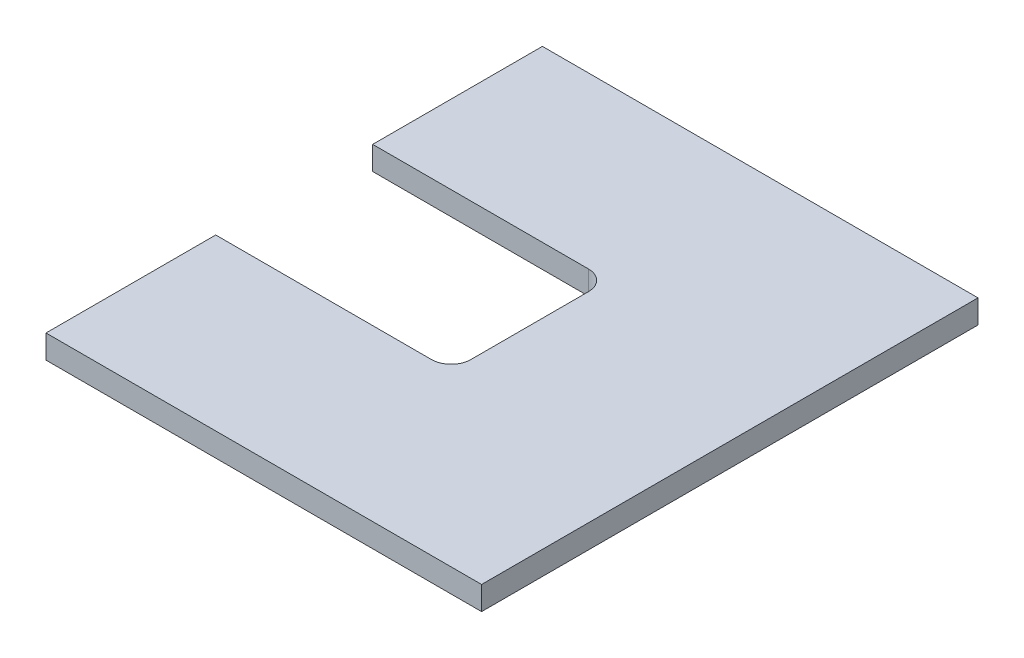
ISO-10303-21;
HEADER;
FILE_DESCRIPTION(('STEP AP214'),'2;1');
FILE_NAME('part.step','',(''),(''),'','','');
FILE_SCHEMA(('AUTOMOTIVE_DESIGN { 1 0 10303 214 1 1 1 1 }'));
ENDSEC;
DATA;
#1=APPLICATION_CONTEXT('core data for automotive mechanical design processes');
#2=APPLICATION_PROTOCOL_DEFINITION('international standard','automotive_design',2000,#1);
#3=PRODUCT_CONTEXT('',#1,'mechanical');
#4=PRODUCT('Part','Part','',(#3));
#5=PRODUCT_RELATED_PRODUCT_CATEGORY('part','',(#4));
#6=PRODUCT_DEFINITION_FORMATION('','',#4);
#7=PRODUCT_DEFINITION_CONTEXT('part definition',#1,'design');
#8=PRODUCT_DEFINITION('design','',#6,#7);
#9=PRODUCT_DEFINITION_SHAPE('','',#8);
#10=(LENGTH_UNIT() NAMED_UNIT(*) SI_UNIT(.MILLI.,.METRE.));
#11=(NAMED_UNIT(*) PLANE_ANGLE_UNIT() SI_UNIT($,.RADIAN.));
#12=(NAMED_UNIT(*) SI_UNIT($,.STERADIAN.) SOLID_ANGLE_UNIT());
#13=UNCERTAINTY_MEASURE_WITH_UNIT(LENGTH_MEASURE(1.E-05),#10,'distance_accuracy_value','');
#14=(GEOMETRIC_REPRESENTATION_CONTEXT(3) GLOBAL_UNCERTAINTY_ASSIGNED_CONTEXT((#13)) GLOBAL_UNIT_ASSIGNED_CONTEXT((#10,
#11,#12)) REPRESENTATION_CONTEXT('',''));
#15=CARTESIAN_POINT('',(0.,0.,0.));
#16=DIRECTION('',(0.,0.,1.));
#17=DIRECTION('',(1.,0.,0.));
#18=AXIS2_PLACEMENT_3D('',#15,#16,#17);
#19=CARTESIAN_POINT('',(0.,6.,0.));
#20=DIRECTION('',(1.,0.,0.));
#21=DIRECTION('',(0.,0.,-1.));
#22=AXIS2_PLACEMENT_3D('',#19,#20,#21);
#23=PLANE('',#22);
#24=DIRECTION('',(0.,0.,1.));
#25=VECTOR('',#24,1.);
#26=CARTESIAN_POINT('',(0.,0.,0.));
#27=LINE('',#26,#25);
#28=CARTESIAN_POINT('',(0.,0.,-126.5));
#29=VERTEX_POINT('',#28);
#30=CARTESIAN_POINT('',(0.,0.,-83.25));
#31=VERTEX_POINT('',#30);
#32=EDGE_CURVE('E139',#29,#31,#27,.T.);
#33=ORIENTED_EDGE('',*,*,#32,.T.);
#34=DIRECTION('',(0.,1.,0.));
#35=VECTOR('',#34,1.);
#36=CARTESIAN_POINT('',(0.,0.,-83.25));
#37=LINE('',#36,#35);
#38=CARTESIAN_POINT('',(0.,6.,-83.25));
#39=VERTEX_POINT('',#38);
#40=EDGE_CURVE('E132',#31,#39,#37,.T.);
#41=ORIENTED_EDGE('',*,*,#40,.T.);
#42=DIRECTION('',(0.,0.,1.));
#43=VECTOR('',#42,1.);
#44=CARTESIAN_POINT('',(0.,6.,0.));
#45=LINE('',#44,#43);
#46=CARTESIAN_POINT('',(0.,6.,-126.5));
#47=VERTEX_POINT('',#46);
#48=EDGE_CURVE('E197',#47,#39,#45,.T.);
#49=ORIENTED_EDGE('',*,*,#48,.F.);
#50=DIRECTION('',(0.,-1.,0.));
#51=VECTOR('',#50,1.);
#52=CARTESIAN_POINT('',(0.,6.,-126.5));
#53=LINE('',#52,#51);
#54=EDGE_CURVE('E153',#47,#29,#53,.T.);
#55=ORIENTED_EDGE('',*,*,#54,.T.);
#56=EDGE_LOOP('',(#33,#41,#49,#55));
#57=FACE_BOUND('',#56,.T.);
#58=ADVANCED_FACE('F37',(#57),#23,.F.);
#59=CARTESIAN_POINT('',(0.,6.,-43.25));
#60=VERTEX_POINT('',#59);
#61=CARTESIAN_POINT('',(0.,6.,0.));
#62=VERTEX_POINT('',#61);
#63=EDGE_CURVE('E131',#60,#62,#45,.T.);
#64=ORIENTED_EDGE('',*,*,#63,.F.);
#65=DIRECTION('',(0.,1.,0.));
#66=VECTOR('',#65,1.);
#67=CARTESIAN_POINT('',(0.,0.,-43.25));
#68=LINE('',#67,#66);
#69=CARTESIAN_POINT('',(0.,0.,-43.25));
#70=VERTEX_POINT('',#69);
#71=EDGE_CURVE('E116',#70,#60,#68,.T.);
#72=ORIENTED_EDGE('',*,*,#71,.F.);
#73=CARTESIAN_POINT('',(0.,0.,0.));
#74=VERTEX_POINT('',#73);
#75=EDGE_CURVE('E129',#70,#74,#27,.T.);
#76=ORIENTED_EDGE('',*,*,#75,.T.);
#77=DIRECTION('',(0.,-1.,0.));
#78=VECTOR('',#77,1.);
#79=CARTESIAN_POINT('',(0.,6.,0.));
#80=LINE('',#79,#78);
#81=EDGE_CURVE('E162',#62,#74,#80,.T.);
#82=ORIENTED_EDGE('',*,*,#81,.F.);
#83=EDGE_LOOP('',(#64,#72,#76,#82));
#84=FACE_BOUND('',#83,.T.);
#85=ADVANCED_FACE('F127',(#84),#23,.F.);
#86=CARTESIAN_POINT('',(0.,6.,0.));
#87=DIRECTION('',(0.,0.,-1.));
#88=DIRECTION('',(-1.,0.,0.));
#89=AXIS2_PLACEMENT_3D('',#86,#87,#88);
#90=PLANE('',#89);
#91=DIRECTION('',(1.,0.,0.));
#92=VECTOR('',#91,1.);
#93=CARTESIAN_POINT('',(0.,0.,0.));
#94=LINE('',#93,#92);
#95=CARTESIAN_POINT('',(111.,0.,0.));
#96=VERTEX_POINT('',#95);
#97=EDGE_CURVE('E137',#74,#96,#94,.T.);
#98=ORIENTED_EDGE('',*,*,#97,.T.);
#99=DIRECTION('',(0.,-1.,0.));
#100=VECTOR('',#99,1.);
#101=CARTESIAN_POINT('',(111.,6.,0.));
#102=LINE('',#101,#100);
#103=CARTESIAN_POINT('',(111.,6.,0.));
#104=VERTEX_POINT('',#103);
#105=EDGE_CURVE('E159',#104,#96,#102,.T.);
#106=ORIENTED_EDGE('',*,*,#105,.F.);
#107=DIRECTION('',(1.,0.,0.));
#108=VECTOR('',#107,1.);
#109=CARTESIAN_POINT('',(0.,6.,0.));
#110=LINE('',#109,#108);
#111=EDGE_CURVE('E199',#62,#104,#110,.T.);
#112=ORIENTED_EDGE('',*,*,#111,.F.);
#113=ORIENTED_EDGE('',*,*,#81,.T.);
#114=EDGE_LOOP('',(#98,#106,#112,#113));
#115=FACE_BOUND('',#114,.T.);
#116=ADVANCED_FACE('F215',(#115),#90,.F.);
#117=CARTESIAN_POINT('',(111.,6.,0.));
#118=DIRECTION('',(-1.,0.,0.));
#119=DIRECTION('',(0.,0.,1.));
#120=AXIS2_PLACEMENT_3D('',#117,#118,#119);
#121=PLANE('',#120);
#122=DIRECTION('',(0.,0.,-1.));
#123=VECTOR('',#122,1.);
#124=CARTESIAN_POINT('',(111.,0.,0.));
#125=LINE('',#124,#123);
#126=CARTESIAN_POINT('',(111.,0.,-126.5));
#127=VERTEX_POINT('',#126);
#128=EDGE_CURVE('E149',#96,#127,#125,.T.);
#129=ORIENTED_EDGE('',*,*,#128,.T.);
#130=DIRECTION('',(0.,-1.,0.));
#131=VECTOR('',#130,1.);
#132=CARTESIAN_POINT('',(111.,6.,-126.5));
#133=LINE('',#132,#131);
#134=CARTESIAN_POINT('',(111.,6.,-126.5));
#135=VERTEX_POINT('',#134);
#136=EDGE_CURVE('E156',#135,#127,#133,.T.);
#137=ORIENTED_EDGE('',*,*,#136,.F.);
#138=DIRECTION('',(0.,0.,-1.));
#139=VECTOR('',#138,1.);
#140=CARTESIAN_POINT('',(111.,6.,0.));
#141=LINE('',#140,#139);
#142=EDGE_CURVE('E200',#104,#135,#141,.T.);
#143=ORIENTED_EDGE('',*,*,#142,.F.);
#144=ORIENTED_EDGE('',*,*,#105,.T.);
#145=EDGE_LOOP('',(#129,#137,#143,#144));
#146=FACE_BOUND('',#145,.T.);
#147=ADVANCED_FACE('F211',(#146),#121,.F.);
#148=CARTESIAN_POINT('',(0.,6.,-126.5));
#149=DIRECTION('',(0.,0.,1.));
#150=DIRECTION('',(1.,0.,0.));
#151=AXIS2_PLACEMENT_3D('',#148,#149,#150);
#152=PLANE('',#151);
#153=DIRECTION('',(-1.,0.,0.));
#154=VECTOR('',#153,1.);
#155=CARTESIAN_POINT('',(0.,0.,-126.5));
#156=LINE('',#155,#154);
#157=EDGE_CURVE('E151',#127,#29,#156,.T.);
#158=ORIENTED_EDGE('',*,*,#157,.T.);
#159=ORIENTED_EDGE('',*,*,#54,.F.);
#160=DIRECTION('',(-1.,0.,0.));
#161=VECTOR('',#160,1.);
#162=CARTESIAN_POINT('',(0.,6.,-126.5));
#163=LINE('',#162,#161);
#164=EDGE_CURVE('E146',#135,#47,#163,.T.);
#165=ORIENTED_EDGE('',*,*,#164,.F.);
#166=ORIENTED_EDGE('',*,*,#136,.T.);
#167=EDGE_LOOP('',(#158,#159,#165,#166));
#168=FACE_BOUND('',#167,.T.);
#169=ADVANCED_FACE('F207',(#168),#152,.F.);
#170=CARTESIAN_POINT('',(0.,6.,0.));
#171=DIRECTION('',(0.,-1.,0.));
#172=DIRECTION('',(0.,0.,-1.));
#173=AXIS2_PLACEMENT_3D('',#170,#171,#172);
#174=PLANE('',#173);
#175=ORIENTED_EDGE('',*,*,#48,.T.);
#176=DIRECTION('',(-1.,0.,0.));
#177=VECTOR('',#176,1.);
#178=CARTESIAN_POINT('',(0.,6.,-83.25));
#179=LINE('',#178,#177);
#180=CARTESIAN_POINT('',(55.,6.,-83.25));
#181=VERTEX_POINT('',#180);
#182=EDGE_CURVE('E123',#181,#39,#179,.T.);
#183=ORIENTED_EDGE('',*,*,#182,.F.);
#184=CARTESIAN_POINT('',(55.,6.,-78.25));
#185=DIRECTION('',(0.,-1.,0.));
#186=DIRECTION('',(0.,0.,-1.));
#187=AXIS2_PLACEMENT_3D('',#184,#185,#186);
#188=CIRCLE('',#187,5.);
#189=CARTESIAN_POINT('',(60.,6.,-78.25));
#190=VERTEX_POINT('',#189);
#191=EDGE_CURVE('E45',#181,#190,#188,.T.);
#192=ORIENTED_EDGE('',*,*,#191,.T.);
#193=DIRECTION('',(0.,0.,-1.));
#194=VECTOR('',#193,1.);
#195=CARTESIAN_POINT('',(60.,6.,-83.25));
#196=LINE('',#195,#194);
#197=CARTESIAN_POINT('',(60.,6.,-48.25));
#198=VERTEX_POINT('',#197);
#199=EDGE_CURVE('E181',#198,#190,#196,.T.);
#200=ORIENTED_EDGE('',*,*,#199,.F.);
#201=CARTESIAN_POINT('',(55.,6.,-48.25));
#202=DIRECTION('',(0.,-1.,0.));
#203=DIRECTION('',(0.,0.,-1.));
#204=AXIS2_PLACEMENT_3D('',#201,#202,#203);
#205=CIRCLE('',#204,5.);
#206=CARTESIAN_POINT('',(55.,6.,-43.25));
#207=VERTEX_POINT('',#206);
#208=EDGE_CURVE('E172',#198,#207,#205,.T.);
#209=ORIENTED_EDGE('',*,*,#208,.T.);
#210=DIRECTION('',(1.,0.,0.));
#211=VECTOR('',#210,1.);
#212=CARTESIAN_POINT('',(0.,6.,-43.25));
#213=LINE('',#212,#211);
#214=EDGE_CURVE('E186',#60,#207,#213,.T.);
#215=ORIENTED_EDGE('',*,*,#214,.F.);
#216=ORIENTED_EDGE('',*,*,#63,.T.);
#217=ORIENTED_EDGE('',*,*,#111,.T.);
#218=ORIENTED_EDGE('',*,*,#142,.T.);
#219=ORIENTED_EDGE('',*,*,#164,.T.);
#220=EDGE_LOOP('',(#175,#183,#192,#200,#209,#215,#216,#217,#218,#219));
#221=FACE_BOUND('',#220,.T.);
#222=ADVANCED_FACE('F180',(#221),#174,.F.);
#223=CARTESIAN_POINT('',(0.,0.,0.));
#224=DIRECTION('',(0.,-1.,0.));
#225=DIRECTION('',(0.,0.,-1.));
#226=AXIS2_PLACEMENT_3D('',#223,#224,#225);
#227=PLANE('',#226);
#228=DIRECTION('',(0.,0.,-1.));
#229=VECTOR('',#228,1.);
#230=CARTESIAN_POINT('',(60.,0.,-83.25));
#231=LINE('',#230,#229);
#232=CARTESIAN_POINT('',(60.,0.,-48.25));
#233=VERTEX_POINT('',#232);
#234=CARTESIAN_POINT('',(60.,0.,-78.25));
#235=VERTEX_POINT('',#234);
#236=EDGE_CURVE('E122',#233,#235,#231,.T.);
#237=ORIENTED_EDGE('',*,*,#236,.T.);
#238=CARTESIAN_POINT('',(55.,0.,-78.25));
#239=DIRECTION('',(0.,-1.,0.));
#240=DIRECTION('',(0.,0.,-1.));
#241=AXIS2_PLACEMENT_3D('',#238,#239,#240);
#242=CIRCLE('',#241,5.);
#243=CARTESIAN_POINT('',(55.,0.,-83.25));
#244=VERTEX_POINT('',#243);
#245=EDGE_CURVE('E11',#235,#244,#242,.F.);
#246=ORIENTED_EDGE('',*,*,#245,.T.);
#247=DIRECTION('',(-1.,0.,0.));
#248=VECTOR('',#247,1.);
#249=CARTESIAN_POINT('',(0.,0.,-83.25));
#250=LINE('',#249,#248);
#251=EDGE_CURVE('E133',#244,#31,#250,.T.);
#252=ORIENTED_EDGE('',*,*,#251,.T.);
#253=ORIENTED_EDGE('',*,*,#32,.F.);
#254=ORIENTED_EDGE('',*,*,#157,.F.);
#255=ORIENTED_EDGE('',*,*,#128,.F.);
#256=ORIENTED_EDGE('',*,*,#97,.F.);
#257=ORIENTED_EDGE('',*,*,#75,.F.);
#258=DIRECTION('',(1.,0.,0.));
#259=VECTOR('',#258,1.);
#260=CARTESIAN_POINT('',(0.,0.,-43.25));
#261=LINE('',#260,#259);
#262=CARTESIAN_POINT('',(55.,0.,-43.25));
#263=VERTEX_POINT('',#262);
#264=EDGE_CURVE('E112',#70,#263,#261,.T.);
#265=ORIENTED_EDGE('',*,*,#264,.T.);
#266=CARTESIAN_POINT('',(55.,0.,-48.25));
#267=DIRECTION('',(0.,-1.,0.));
#268=DIRECTION('',(0.,0.,-1.));
#269=AXIS2_PLACEMENT_3D('',#266,#267,#268);
#270=CIRCLE('',#269,5.);
#271=EDGE_CURVE('E174',#263,#233,#270,.F.);
#272=ORIENTED_EDGE('',*,*,#271,.T.);
#273=EDGE_LOOP('',(#237,#246,#252,#253,#254,#255,#256,#257,#265,#272));
#274=FACE_BOUND('',#273,.T.);
#275=ADVANCED_FACE('F135',(#274),#227,.T.);
#276=CARTESIAN_POINT('',(0.,0.,-83.25));
#277=DIRECTION('',(0.,0.,-1.));
#278=DIRECTION('',(-1.,0.,0.));
#279=AXIS2_PLACEMENT_3D('',#276,#277,#278);
#280=PLANE('',#279);
#281=ORIENTED_EDGE('',*,*,#251,.F.);
#282=DIRECTION('',(0.,1.,0.));
#283=VECTOR('',#282,1.);
#284=CARTESIAN_POINT('',(55.,6.,-83.25));
#285=LINE('',#284,#283);
#286=EDGE_CURVE('E170',#244,#181,#285,.T.);
#287=ORIENTED_EDGE('',*,*,#286,.T.);
#288=ORIENTED_EDGE('',*,*,#182,.T.);
#289=ORIENTED_EDGE('',*,*,#40,.F.);
#290=EDGE_LOOP('',(#281,#287,#288,#289));
#291=FACE_BOUND('',#290,.T.);
#292=ADVANCED_FACE('F189',(#291),#280,.F.);
#293=CARTESIAN_POINT('',(60.,0.,-83.25));
#294=DIRECTION('',(1.,0.,0.));
#295=DIRECTION('',(0.,0.,-1.));
#296=AXIS2_PLACEMENT_3D('',#293,#294,#295);
#297=PLANE('',#296);
#298=ORIENTED_EDGE('',*,*,#236,.F.);
#299=DIRECTION('',(0.,1.,0.));
#300=VECTOR('',#299,1.);
#301=CARTESIAN_POINT('',(60.,6.,-48.25));
#302=LINE('',#301,#300);
#303=EDGE_CURVE('E166',#233,#198,#302,.T.);
#304=ORIENTED_EDGE('',*,*,#303,.T.);
#305=ORIENTED_EDGE('',*,*,#199,.T.);
#306=DIRECTION('',(0.,1.,0.));
#307=VECTOR('',#306,1.);
#308=CARTESIAN_POINT('',(60.,0.,-78.25));
#309=LINE('',#308,#307);
#310=EDGE_CURVE('E164',#190,#235,#309,.F.);
#311=ORIENTED_EDGE('',*,*,#310,.T.);
#312=EDGE_LOOP('',(#298,#304,#305,#311));
#313=FACE_BOUND('',#312,.T.);
#314=ADVANCED_FACE('F184',(#313),#297,.F.);
#315=CARTESIAN_POINT('',(0.,0.,-43.25));
#316=DIRECTION('',(0.,0.,1.));
#317=DIRECTION('',(1.,0.,0.));
#318=AXIS2_PLACEMENT_3D('',#315,#316,#317);
#319=PLANE('',#318);
#320=ORIENTED_EDGE('',*,*,#214,.T.);
#321=DIRECTION('',(0.,1.,0.));
#322=VECTOR('',#321,1.);
#323=CARTESIAN_POINT('',(55.,0.,-43.25));
#324=LINE('',#323,#322);
#325=EDGE_CURVE('E119',#207,#263,#324,.F.);
#326=ORIENTED_EDGE('',*,*,#325,.T.);
#327=ORIENTED_EDGE('',*,*,#264,.F.);
#328=ORIENTED_EDGE('',*,*,#71,.T.);
#329=EDGE_LOOP('',(#320,#326,#327,#328));
#330=FACE_BOUND('',#329,.T.);
#331=ADVANCED_FACE('F115',(#330),#319,.F.);
#332=CARTESIAN_POINT('',(55.,0.,-48.25));
#333=DIRECTION('',(0.,-1.,0.));
#334=DIRECTION('',(0.,0.,-1.));
#335=AXIS2_PLACEMENT_3D('',#332,#333,#334);
#336=CYLINDRICAL_SURFACE('',#335,5.);
#337=ORIENTED_EDGE('',*,*,#271,.F.);
#338=ORIENTED_EDGE('',*,*,#325,.F.);
#339=ORIENTED_EDGE('',*,*,#208,.F.);
#340=ORIENTED_EDGE('',*,*,#303,.F.);
#341=EDGE_LOOP('',(#337,#338,#339,#340));
#342=FACE_BOUND('',#341,.T.);
#343=ADVANCED_FACE('F217',(#342),#336,.F.);
#344=CARTESIAN_POINT('',(55.,0.,-78.25));
#345=DIRECTION('',(0.,-1.,0.));
#346=DIRECTION('',(0.,0.,-1.));
#347=AXIS2_PLACEMENT_3D('',#344,#345,#346);
#348=CYLINDRICAL_SURFACE('',#347,5.);
#349=ORIENTED_EDGE('',*,*,#245,.F.);
#350=ORIENTED_EDGE('',*,*,#310,.F.);
#351=ORIENTED_EDGE('',*,*,#191,.F.);
#352=ORIENTED_EDGE('',*,*,#286,.F.);
#353=EDGE_LOOP('',(#349,#350,#351,#352));
#354=FACE_BOUND('',#353,.T.);
#355=ADVANCED_FACE('F39',(#354),#348,.F.);
#356=CLOSED_SHELL('',(#58,#85,#116,#147,#169,#222,#275,#292,#314,#331,#343,#355));
#357=MANIFOLD_SOLID_BREP('B2',#356);
#358=ADVANCED_BREP_SHAPE_REPRESENTATION('',(#18,#357),#14);
#359=SHAPE_DEFINITION_REPRESENTATION(#9,#358);
ENDSEC;
END-ISO-10303-21;
